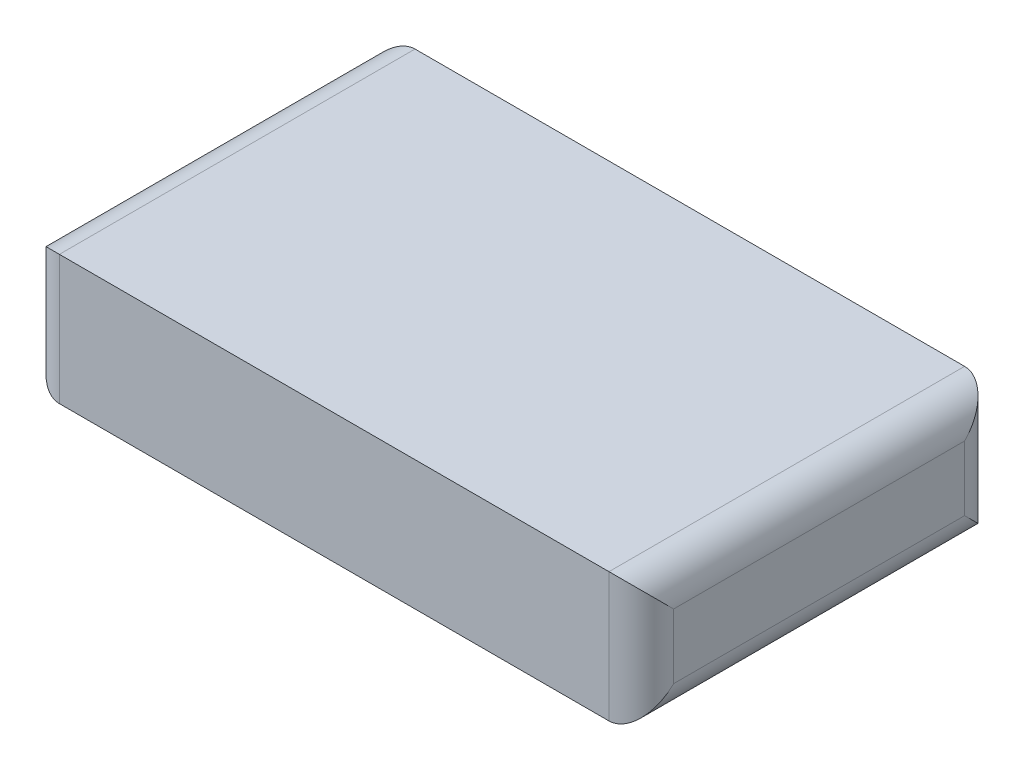
ISO-10303-21;
HEADER;
FILE_DESCRIPTION(('STEP AP214'),'2;1');
FILE_NAME('part.step','',(''),(''),'','','');
FILE_SCHEMA(('AUTOMOTIVE_DESIGN { 1 0 10303 214 1 1 1 1 }'));
ENDSEC;
DATA;
#1=APPLICATION_CONTEXT('core data for automotive mechanical design processes');
#2=APPLICATION_PROTOCOL_DEFINITION('international standard','automotive_design',2000,#1);
#3=PRODUCT_CONTEXT('',#1,'mechanical');
#4=PRODUCT('Part','Part','',(#3));
#5=PRODUCT_RELATED_PRODUCT_CATEGORY('part','',(#4));
#6=PRODUCT_DEFINITION_FORMATION('','',#4);
#7=PRODUCT_DEFINITION_CONTEXT('part definition',#1,'design');
#8=PRODUCT_DEFINITION('design','',#6,#7);
#9=PRODUCT_DEFINITION_SHAPE('','',#8);
#10=(LENGTH_UNIT() NAMED_UNIT(*) SI_UNIT(.MILLI.,.METRE.));
#11=(NAMED_UNIT(*) PLANE_ANGLE_UNIT() SI_UNIT($,.RADIAN.));
#12=(NAMED_UNIT(*) SI_UNIT($,.STERADIAN.) SOLID_ANGLE_UNIT());
#13=UNCERTAINTY_MEASURE_WITH_UNIT(LENGTH_MEASURE(1.E-05),#10,'distance_accuracy_value','');
#14=(GEOMETRIC_REPRESENTATION_CONTEXT(3) GLOBAL_UNCERTAINTY_ASSIGNED_CONTEXT((#13)) GLOBAL_UNIT_ASSIGNED_CONTEXT((#10,
#11,#12)) REPRESENTATION_CONTEXT('',''));
#15=CARTESIAN_POINT('',(0.,0.,0.));
#16=DIRECTION('',(0.,0.,1.));
#17=DIRECTION('',(1.,0.,0.));
#18=AXIS2_PLACEMENT_3D('',#15,#16,#17);
#19=CARTESIAN_POINT('',(1.00000000000001,4.,-6.703125));
#20=DIRECTION('',(-1.,0.,0.));
#21=DIRECTION('',(0.,0.,1.));
#22=AXIS2_PLACEMENT_3D('',#19,#20,#21);
#23=PLANE('',#22);
#24=DIRECTION('',(0.,0.,-1.));
#25=VECTOR('',#24,1.);
#26=CARTESIAN_POINT('',(1.00000000000001,3.,4.296875));
#27=LINE('',#26,#25);
#28=CARTESIAN_POINT('',(1.00000000000001,3.,-5.703125));
#29=VERTEX_POINT('',#28);
#30=CARTESIAN_POINT('',(1.00000000000001,3.,3.296875));
#31=VERTEX_POINT('',#30);
#32=EDGE_CURVE('E123',#29,#31,#27,.F.);
#33=ORIENTED_EDGE('',*,*,#32,.T.);
#34=DIRECTION('',(0.,-1.,0.));
#35=VECTOR('',#34,1.);
#36=CARTESIAN_POINT('',(1.00000000000001,4.,3.296875));
#37=LINE('',#36,#35);
#38=CARTESIAN_POINT('',(1.00000000000001,1.,3.296875));
#39=VERTEX_POINT('',#38);
#40=EDGE_CURVE('E105',#31,#39,#37,.T.);
#41=ORIENTED_EDGE('',*,*,#40,.T.);
#42=DIRECTION('',(0.,0.,-1.));
#43=VECTOR('',#42,1.);
#44=CARTESIAN_POINT('',(1.00000000000001,1.,-6.703125));
#45=LINE('',#44,#43);
#46=CARTESIAN_POINT('',(1.00000000000001,1.,-5.703125));
#47=VERTEX_POINT('',#46);
#48=EDGE_CURVE('E113',#39,#47,#45,.T.);
#49=ORIENTED_EDGE('',*,*,#48,.T.);
#50=DIRECTION('',(0.,-1.,0.));
#51=VECTOR('',#50,1.);
#52=CARTESIAN_POINT('',(1.00000000000001,4.,-5.703125));
#53=LINE('',#52,#51);
#54=EDGE_CURVE('E119',#47,#29,#53,.F.);
#55=ORIENTED_EDGE('',*,*,#54,.T.);
#56=EDGE_LOOP('',(#33,#41,#49,#55));
#57=FACE_BOUND('',#56,.T.);
#58=ADVANCED_FACE('F35',(#57),#23,.F.);
#59=CARTESIAN_POINT('',(-18.,4.,-6.703125));
#60=DIRECTION('',(0.,0.,1.));
#61=DIRECTION('',(1.,0.,0.));
#62=AXIS2_PLACEMENT_3D('',#59,#60,#61);
#63=PLANE('',#62);
#64=DIRECTION('',(-1.,0.,0.));
#65=VECTOR('',#64,1.);
#66=CARTESIAN_POINT('',(-18.,4.,-6.703125));
#67=LINE('',#66,#65);
#68=CARTESIAN_POINT('',(0.,4.,-6.703125));
#69=VERTEX_POINT('',#68);
#70=CARTESIAN_POINT('',(-17.,4.,-6.703125));
#71=VERTEX_POINT('',#70);
#72=EDGE_CURVE('E181',#69,#71,#67,.T.);
#73=ORIENTED_EDGE('',*,*,#72,.F.);
#74=DIRECTION('',(0.,-1.,0.));
#75=VECTOR('',#74,1.);
#76=CARTESIAN_POINT('',(0.,4.,-6.703125));
#77=LINE('',#76,#75);
#78=CARTESIAN_POINT('',(0.,0.,-6.703125));
#79=VERTEX_POINT('',#78);
#80=EDGE_CURVE('E139',#69,#79,#77,.T.);
#81=ORIENTED_EDGE('',*,*,#80,.T.);
#82=DIRECTION('',(-1.,0.,0.));
#83=VECTOR('',#82,1.);
#84=CARTESIAN_POINT('',(-18.,0.,-6.703125));
#85=LINE('',#84,#83);
#86=CARTESIAN_POINT('',(-17.,0.,-6.703125));
#87=VERTEX_POINT('',#86);
#88=EDGE_CURVE('E154',#79,#87,#85,.T.);
#89=ORIENTED_EDGE('',*,*,#88,.T.);
#90=DIRECTION('',(0.,-1.,0.));
#91=VECTOR('',#90,1.);
#92=CARTESIAN_POINT('',(-17.,4.,-6.703125));
#93=LINE('',#92,#91);
#94=EDGE_CURVE('E136',#87,#71,#93,.F.);
#95=ORIENTED_EDGE('',*,*,#94,.T.);
#96=EDGE_LOOP('',(#73,#81,#89,#95));
#97=FACE_BOUND('',#96,.T.);
#98=ADVANCED_FACE('F198',(#97),#63,.F.);
#99=CARTESIAN_POINT('',(-18.,4.,-6.703125));
#100=DIRECTION('',(1.,0.,0.));
#101=DIRECTION('',(0.,0.,-1.));
#102=AXIS2_PLACEMENT_3D('',#99,#100,#101);
#103=PLANE('',#102);
#104=DIRECTION('',(0.,0.,1.));
#105=VECTOR('',#104,1.);
#106=CARTESIAN_POINT('',(-18.,3.,-6.703125));
#107=LINE('',#106,#105);
#108=CARTESIAN_POINT('',(-18.,3.,3.296875));
#109=VERTEX_POINT('',#108);
#110=CARTESIAN_POINT('',(-18.,3.,-5.703125));
#111=VERTEX_POINT('',#110);
#112=EDGE_CURVE('E44',#109,#111,#107,.F.);
#113=ORIENTED_EDGE('',*,*,#112,.T.);
#114=DIRECTION('',(0.,-1.,0.));
#115=VECTOR('',#114,1.);
#116=CARTESIAN_POINT('',(-18.,4.,-5.703125));
#117=LINE('',#116,#115);
#118=CARTESIAN_POINT('',(-18.,1.,-5.703125));
#119=VERTEX_POINT('',#118);
#120=EDGE_CURVE('E11',#111,#119,#117,.T.);
#121=ORIENTED_EDGE('',*,*,#120,.T.);
#122=DIRECTION('',(0.,0.,1.));
#123=VECTOR('',#122,1.);
#124=CARTESIAN_POINT('',(-18.,1.,-6.703125));
#125=LINE('',#124,#123);
#126=CARTESIAN_POINT('',(-18.,1.,3.296875));
#127=VERTEX_POINT('',#126);
#128=EDGE_CURVE('E145',#119,#127,#125,.T.);
#129=ORIENTED_EDGE('',*,*,#128,.T.);
#130=DIRECTION('',(0.,-1.,0.));
#131=VECTOR('',#130,1.);
#132=CARTESIAN_POINT('',(-18.,4.,3.296875));
#133=LINE('',#132,#131);
#134=EDGE_CURVE('E55',#127,#109,#133,.F.);
#135=ORIENTED_EDGE('',*,*,#134,.T.);
#136=EDGE_LOOP('',(#113,#121,#129,#135));
#137=FACE_BOUND('',#136,.T.);
#138=ADVANCED_FACE('F205',(#137),#103,.F.);
#139=CARTESIAN_POINT('',(-18.,4.,4.296875));
#140=DIRECTION('',(0.,0.,-1.));
#141=DIRECTION('',(-1.,0.,0.));
#142=AXIS2_PLACEMENT_3D('',#139,#140,#141);
#143=PLANE('',#142);
#144=DIRECTION('',(1.,0.,0.));
#145=VECTOR('',#144,1.);
#146=CARTESIAN_POINT('',(-18.,0.,4.296875));
#147=LINE('',#146,#145);
#148=CARTESIAN_POINT('',(-17.,0.,4.296875));
#149=VERTEX_POINT('',#148);
#150=CARTESIAN_POINT('',(0.,0.,4.296875));
#151=VERTEX_POINT('',#150);
#152=EDGE_CURVE('E175',#149,#151,#147,.T.);
#153=ORIENTED_EDGE('',*,*,#152,.T.);
#154=DIRECTION('',(0.,-1.,0.));
#155=VECTOR('',#154,1.);
#156=CARTESIAN_POINT('',(0.,4.,4.296875));
#157=LINE('',#156,#155);
#158=CARTESIAN_POINT('',(0.,4.,4.296875));
#159=VERTEX_POINT('',#158);
#160=EDGE_CURVE('E107',#151,#159,#157,.F.);
#161=ORIENTED_EDGE('',*,*,#160,.T.);
#162=DIRECTION('',(1.,0.,0.));
#163=VECTOR('',#162,1.);
#164=CARTESIAN_POINT('',(-18.,4.,4.296875));
#165=LINE('',#164,#163);
#166=CARTESIAN_POINT('',(-17.,4.,4.296875));
#167=VERTEX_POINT('',#166);
#168=EDGE_CURVE('E120',#167,#159,#165,.T.);
#169=ORIENTED_EDGE('',*,*,#168,.F.);
#170=DIRECTION('',(0.,-1.,0.));
#171=VECTOR('',#170,1.);
#172=CARTESIAN_POINT('',(-17.,4.,4.296875));
#173=LINE('',#172,#171);
#174=EDGE_CURVE('E125',#167,#149,#173,.T.);
#175=ORIENTED_EDGE('',*,*,#174,.T.);
#176=EDGE_LOOP('',(#153,#161,#169,#175));
#177=FACE_BOUND('',#176,.T.);
#178=ADVANCED_FACE('F174',(#177),#143,.F.);
#179=CARTESIAN_POINT('',(0.,4.,0.));
#180=DIRECTION('',(0.,1.,0.));
#181=DIRECTION('',(0.,0.,1.));
#182=AXIS2_PLACEMENT_3D('',#179,#180,#181);
#183=PLANE('',#182);
#184=ORIENTED_EDGE('',*,*,#168,.T.);
#185=DIRECTION('',(0.,0.,-1.));
#186=VECTOR('',#185,1.);
#187=CARTESIAN_POINT('',(0.,4.,-6.703125));
#188=LINE('',#187,#186);
#189=EDGE_CURVE('E134',#159,#69,#188,.T.);
#190=ORIENTED_EDGE('',*,*,#189,.T.);
#191=ORIENTED_EDGE('',*,*,#72,.T.);
#192=DIRECTION('',(0.,0.,1.));
#193=VECTOR('',#192,1.);
#194=CARTESIAN_POINT('',(-17.,4.,4.296875));
#195=LINE('',#194,#193);
#196=EDGE_CURVE('E132',#71,#167,#195,.T.);
#197=ORIENTED_EDGE('',*,*,#196,.T.);
#198=EDGE_LOOP('',(#184,#190,#191,#197));
#199=FACE_BOUND('',#198,.T.);
#200=ADVANCED_FACE('F196',(#199),#183,.T.);
#201=CARTESIAN_POINT('',(0.,0.,0.));
#202=DIRECTION('',(0.,1.,0.));
#203=DIRECTION('',(0.,0.,1.));
#204=AXIS2_PLACEMENT_3D('',#201,#202,#203);
#205=PLANE('',#204);
#206=ORIENTED_EDGE('',*,*,#88,.F.);
#207=DIRECTION('',(0.,0.,-1.));
#208=VECTOR('',#207,1.);
#209=CARTESIAN_POINT('',(0.,0.,0.));
#210=LINE('',#209,#208);
#211=EDGE_CURVE('E143',#79,#151,#210,.F.);
#212=ORIENTED_EDGE('',*,*,#211,.T.);
#213=ORIENTED_EDGE('',*,*,#152,.F.);
#214=DIRECTION('',(0.,0.,1.));
#215=VECTOR('',#214,1.);
#216=CARTESIAN_POINT('',(-17.,0.,0.));
#217=LINE('',#216,#215);
#218=EDGE_CURVE('E141',#149,#87,#217,.F.);
#219=ORIENTED_EDGE('',*,*,#218,.T.);
#220=EDGE_LOOP('',(#206,#212,#213,#219));
#221=FACE_BOUND('',#220,.T.);
#222=ADVANCED_FACE('F179',(#221),#205,.F.);
#223=CARTESIAN_POINT('',(0.,4.,-5.703125));
#224=DIRECTION('',(0.,-1.,0.));
#225=DIRECTION('',(0.,0.,-1.));
#226=AXIS2_PLACEMENT_3D('',#223,#224,#225);
#227=CYLINDRICAL_SURFACE('',#226,1.);
#228=CARTESIAN_POINT('',(0.,1.,-5.703125));
#229=DIRECTION('',(0.,0.707106781186547,-0.707106781186547));
#230=DIRECTION('',(0.,-0.707106781186547,-0.707106781186547));
#231=AXIS2_PLACEMENT_3D('',#228,#229,#230);
#232=ELLIPSE('',#231,1.41421356237309,1.);
#233=EDGE_CURVE('E116',#79,#47,#232,.F.);
#234=ORIENTED_EDGE('',*,*,#233,.F.);
#235=ORIENTED_EDGE('',*,*,#80,.F.);
#236=CARTESIAN_POINT('',(0.,3.,-5.703125));
#237=DIRECTION('',(0.,-0.707106781186547,-0.707106781186547));
#238=DIRECTION('',(0.,-0.707106781186547,0.707106781186547));
#239=AXIS2_PLACEMENT_3D('',#236,#237,#238);
#240=ELLIPSE('',#239,1.41421356237309,1.);
#241=EDGE_CURVE('E151',#29,#69,#240,.F.);
#242=ORIENTED_EDGE('',*,*,#241,.F.);
#243=ORIENTED_EDGE('',*,*,#54,.F.);
#244=EDGE_LOOP('',(#234,#235,#242,#243));
#245=FACE_BOUND('',#244,.T.);
#246=ADVANCED_FACE('F190',(#245),#227,.T.);
#247=CARTESIAN_POINT('',(0.,3.,0.));
#248=DIRECTION('',(0.,0.,1.));
#249=DIRECTION('',(1.,0.,0.));
#250=AXIS2_PLACEMENT_3D('',#247,#248,#249);
#251=CYLINDRICAL_SURFACE('',#250,1.);
#252=ORIENTED_EDGE('',*,*,#241,.T.);
#253=ORIENTED_EDGE('',*,*,#189,.F.);
#254=CARTESIAN_POINT('',(0.,3.,3.296875));
#255=DIRECTION('',(0.,-0.707106781186547,0.707106781186547));
#256=DIRECTION('',(0.,0.707106781186547,0.707106781186547));
#257=AXIS2_PLACEMENT_3D('',#254,#255,#256);
#258=ELLIPSE('',#257,1.41421356237309,1.);
#259=EDGE_CURVE('E110',#31,#159,#258,.T.);
#260=ORIENTED_EDGE('',*,*,#259,.F.);
#261=ORIENTED_EDGE('',*,*,#32,.F.);
#262=EDGE_LOOP('',(#252,#253,#260,#261));
#263=FACE_BOUND('',#262,.T.);
#264=ADVANCED_FACE('F193',(#263),#251,.T.);
#265=CARTESIAN_POINT('',(0.,1.,-6.703125));
#266=DIRECTION('',(0.,0.,-1.));
#267=DIRECTION('',(-1.,0.,0.));
#268=AXIS2_PLACEMENT_3D('',#265,#266,#267);
#269=CYLINDRICAL_SURFACE('',#268,1.);
#270=ORIENTED_EDGE('',*,*,#233,.T.);
#271=ORIENTED_EDGE('',*,*,#48,.F.);
#272=CARTESIAN_POINT('',(0.,1.,3.296875));
#273=DIRECTION('',(0.,-0.707106781186547,-0.707106781186547));
#274=DIRECTION('',(0.,0.707106781186547,-0.707106781186547));
#275=AXIS2_PLACEMENT_3D('',#272,#273,#274);
#276=ELLIPSE('',#275,1.41421356237309,1.);
#277=EDGE_CURVE('E101',#151,#39,#276,.F.);
#278=ORIENTED_EDGE('',*,*,#277,.F.);
#279=ORIENTED_EDGE('',*,*,#211,.F.);
#280=EDGE_LOOP('',(#270,#271,#278,#279));
#281=FACE_BOUND('',#280,.T.);
#282=ADVANCED_FACE('F114',(#281),#269,.T.);
#283=CARTESIAN_POINT('',(0.,4.,3.296875));
#284=DIRECTION('',(0.,-1.,0.));
#285=DIRECTION('',(0.,0.,-1.));
#286=AXIS2_PLACEMENT_3D('',#283,#284,#285);
#287=CYLINDRICAL_SURFACE('',#286,1.);
#288=ORIENTED_EDGE('',*,*,#259,.T.);
#289=ORIENTED_EDGE('',*,*,#160,.F.);
#290=ORIENTED_EDGE('',*,*,#277,.T.);
#291=ORIENTED_EDGE('',*,*,#40,.F.);
#292=EDGE_LOOP('',(#288,#289,#290,#291));
#293=FACE_BOUND('',#292,.T.);
#294=ADVANCED_FACE('F103',(#293),#287,.T.);
#295=CARTESIAN_POINT('',(-17.,4.,3.296875));
#296=DIRECTION('',(0.,-1.,0.));
#297=DIRECTION('',(0.,0.,-1.));
#298=AXIS2_PLACEMENT_3D('',#295,#296,#297);
#299=CYLINDRICAL_SURFACE('',#298,1.);
#300=CARTESIAN_POINT('',(-17.,1.,3.296875));
#301=DIRECTION('',(0.,0.707106781186547,0.707106781186547));
#302=DIRECTION('',(0.,-0.707106781186547,0.707106781186547));
#303=AXIS2_PLACEMENT_3D('',#300,#301,#302);
#304=ELLIPSE('',#303,1.41421356237309,1.);
#305=EDGE_CURVE('E158',#149,#127,#304,.F.);
#306=ORIENTED_EDGE('',*,*,#305,.F.);
#307=ORIENTED_EDGE('',*,*,#174,.F.);
#308=CARTESIAN_POINT('',(-17.,3.,3.296875));
#309=DIRECTION('',(0.,-0.707106781186547,0.707106781186547));
#310=DIRECTION('',(0.,-0.707106781186547,-0.707106781186547));
#311=AXIS2_PLACEMENT_3D('',#308,#309,#310);
#312=ELLIPSE('',#311,1.41421356237309,1.);
#313=EDGE_CURVE('E39',#109,#167,#312,.F.);
#314=ORIENTED_EDGE('',*,*,#313,.F.);
#315=ORIENTED_EDGE('',*,*,#134,.F.);
#316=EDGE_LOOP('',(#306,#307,#314,#315));
#317=FACE_BOUND('',#316,.T.);
#318=ADVANCED_FACE('F37',(#317),#299,.T.);
#319=CARTESIAN_POINT('',(-17.,3.,0.));
#320=DIRECTION('',(0.,0.,-1.));
#321=DIRECTION('',(-1.,0.,0.));
#322=AXIS2_PLACEMENT_3D('',#319,#320,#321);
#323=CYLINDRICAL_SURFACE('',#322,1.);
#324=ORIENTED_EDGE('',*,*,#313,.T.);
#325=ORIENTED_EDGE('',*,*,#196,.F.);
#326=CARTESIAN_POINT('',(-17.,3.,-5.703125));
#327=DIRECTION('',(0.,-0.707106781186547,-0.707106781186547));
#328=DIRECTION('',(0.,0.707106781186547,-0.707106781186547));
#329=AXIS2_PLACEMENT_3D('',#326,#327,#328);
#330=ELLIPSE('',#329,1.41421356237309,1.);
#331=EDGE_CURVE('E157',#111,#71,#330,.T.);
#332=ORIENTED_EDGE('',*,*,#331,.F.);
#333=ORIENTED_EDGE('',*,*,#112,.F.);
#334=EDGE_LOOP('',(#324,#325,#332,#333));
#335=FACE_BOUND('',#334,.T.);
#336=ADVANCED_FACE('F167',(#335),#323,.T.);
#337=CARTESIAN_POINT('',(-17.,1.,-6.703125));
#338=DIRECTION('',(0.,0.,1.));
#339=DIRECTION('',(1.,0.,0.));
#340=AXIS2_PLACEMENT_3D('',#337,#338,#339);
#341=CYLINDRICAL_SURFACE('',#340,1.);
#342=ORIENTED_EDGE('',*,*,#305,.T.);
#343=ORIENTED_EDGE('',*,*,#128,.F.);
#344=CARTESIAN_POINT('',(-17.,1.,-5.703125));
#345=DIRECTION('',(0.,-0.707106781186547,0.707106781186547));
#346=DIRECTION('',(0.,0.707106781186547,0.707106781186547));
#347=AXIS2_PLACEMENT_3D('',#344,#345,#346);
#348=ELLIPSE('',#347,1.41421356237309,1.);
#349=EDGE_CURVE('E155',#87,#119,#348,.F.);
#350=ORIENTED_EDGE('',*,*,#349,.F.);
#351=ORIENTED_EDGE('',*,*,#218,.F.);
#352=EDGE_LOOP('',(#342,#343,#350,#351));
#353=FACE_BOUND('',#352,.T.);
#354=ADVANCED_FACE('F204',(#353),#341,.T.);
#355=CARTESIAN_POINT('',(-17.,4.,-5.703125));
#356=DIRECTION('',(0.,-1.,0.));
#357=DIRECTION('',(0.,0.,-1.));
#358=AXIS2_PLACEMENT_3D('',#355,#356,#357);
#359=CYLINDRICAL_SURFACE('',#358,1.);
#360=ORIENTED_EDGE('',*,*,#331,.T.);
#361=ORIENTED_EDGE('',*,*,#94,.F.);
#362=ORIENTED_EDGE('',*,*,#349,.T.);
#363=ORIENTED_EDGE('',*,*,#120,.F.);
#364=EDGE_LOOP('',(#360,#361,#362,#363));
#365=FACE_BOUND('',#364,.T.);
#366=ADVANCED_FACE('F202',(#365),#359,.T.);
#367=CLOSED_SHELL('',(#58,#98,#138,#178,#200,#222,#246,#264,#282,#294,#318,#336,#354,#366));
#368=MANIFOLD_SOLID_BREP('B2',#367);
#369=ADVANCED_BREP_SHAPE_REPRESENTATION('',(#18,#368),#14);
#370=SHAPE_DEFINITION_REPRESENTATION(#9,#369);
ENDSEC;
END-ISO-10303-21;
